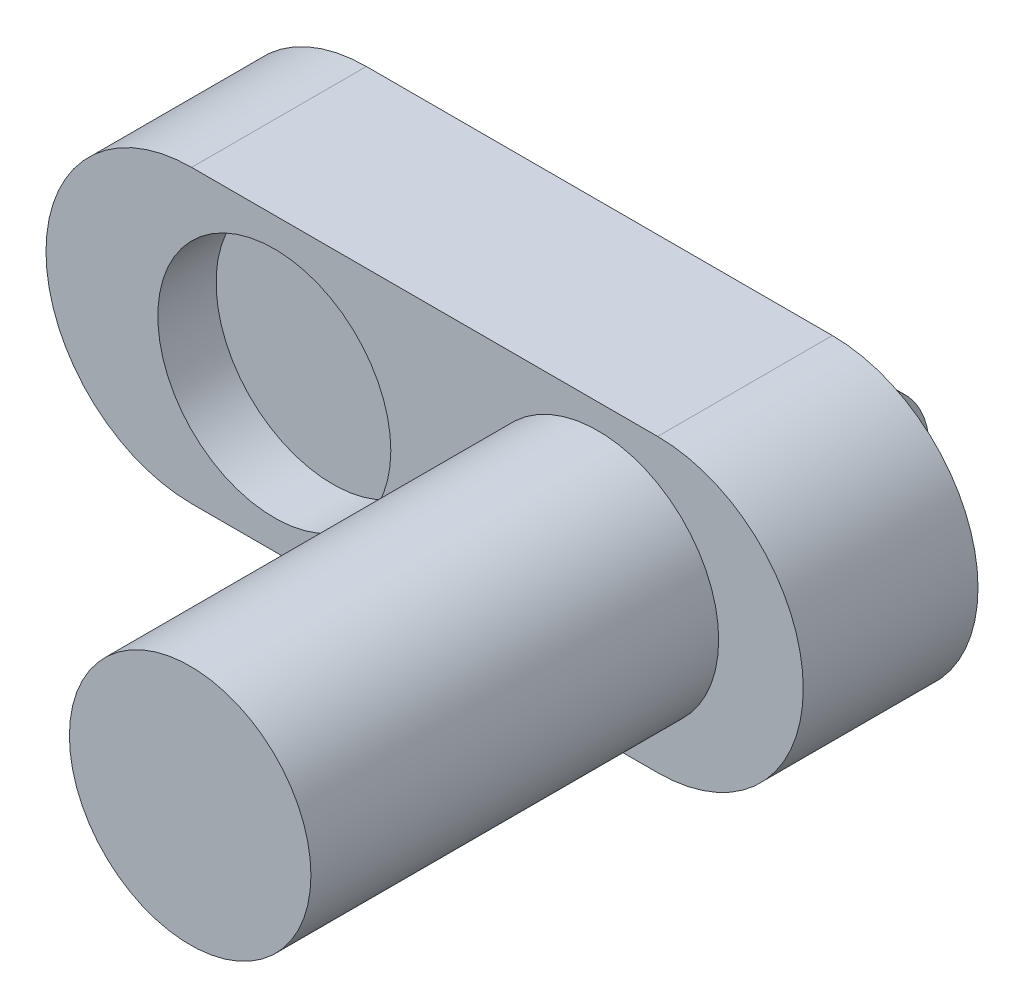
ISO-10303-21;
HEADER;
FILE_DESCRIPTION(('STEP AP214'),'2;1');
FILE_NAME('part.step','',(''),(''),'','','');
FILE_SCHEMA(('AUTOMOTIVE_DESIGN { 1 0 10303 214 1 1 1 1 }'));
ENDSEC;
DATA;
#1=APPLICATION_CONTEXT('core data for automotive mechanical design processes');
#2=APPLICATION_PROTOCOL_DEFINITION('international standard','automotive_design',2000,#1);
#3=PRODUCT_CONTEXT('',#1,'mechanical');
#4=PRODUCT('Part','Part','',(#3));
#5=PRODUCT_RELATED_PRODUCT_CATEGORY('part','',(#4));
#6=PRODUCT_DEFINITION_FORMATION('','',#4);
#7=PRODUCT_DEFINITION_CONTEXT('part definition',#1,'design');
#8=PRODUCT_DEFINITION('design','',#6,#7);
#9=PRODUCT_DEFINITION_SHAPE('','',#8);
#10=(LENGTH_UNIT() NAMED_UNIT(*) SI_UNIT(.MILLI.,.METRE.));
#11=(NAMED_UNIT(*) PLANE_ANGLE_UNIT() SI_UNIT($,.RADIAN.));
#12=(NAMED_UNIT(*) SI_UNIT($,.STERADIAN.) SOLID_ANGLE_UNIT());
#13=UNCERTAINTY_MEASURE_WITH_UNIT(LENGTH_MEASURE(1.E-05),#10,'distance_accuracy_value','');
#14=(GEOMETRIC_REPRESENTATION_CONTEXT(3) GLOBAL_UNCERTAINTY_ASSIGNED_CONTEXT((#13)) GLOBAL_UNIT_ASSIGNED_CONTEXT((#10,
#11,#12)) REPRESENTATION_CONTEXT('',''));
#15=CARTESIAN_POINT('',(0.,0.,0.));
#16=DIRECTION('',(0.,0.,1.));
#17=DIRECTION('',(1.,0.,0.));
#18=AXIS2_PLACEMENT_3D('',#15,#16,#17);
#19=CARTESIAN_POINT('',(-20.,0.,0.));
#20=DIRECTION('',(0.,0.,1.));
#21=DIRECTION('',(1.,0.,0.));
#22=AXIS2_PLACEMENT_3D('',#19,#20,#21);
#23=PLANE('',#22);
#24=CARTESIAN_POINT('',(-20.,0.,0.));
#25=DIRECTION('',(0.,0.,1.));
#26=DIRECTION('',(1.,0.,0.));
#27=AXIS2_PLACEMENT_3D('',#24,#25,#26);
#28=CIRCLE('',#27,12.5);
#29=CARTESIAN_POINT('',(-20.,12.5,0.));
#30=VERTEX_POINT('',#29);
#31=CARTESIAN_POINT('',(-20.,-12.5,0.));
#32=VERTEX_POINT('',#31);
#33=EDGE_CURVE('E180',#30,#32,#28,.T.);
#34=ORIENTED_EDGE('',*,*,#33,.F.);
#35=DIRECTION('',(-1.,0.,0.));
#36=VECTOR('',#35,1.);
#37=CARTESIAN_POINT('',(-20.,12.5,0.));
#38=LINE('',#37,#36);
#39=CARTESIAN_POINT('',(20.,12.5,0.));
#40=VERTEX_POINT('',#39);
#41=EDGE_CURVE('E72',#40,#30,#38,.T.);
#42=ORIENTED_EDGE('',*,*,#41,.F.);
#43=CARTESIAN_POINT('',(20.,0.,0.));
#44=DIRECTION('',(0.,0.,1.));
#45=DIRECTION('',(1.,0.,0.));
#46=AXIS2_PLACEMENT_3D('',#43,#44,#45);
#47=CIRCLE('',#46,12.5);
#48=CARTESIAN_POINT('',(20.,-12.5,0.));
#49=VERTEX_POINT('',#48);
#50=EDGE_CURVE('E185',#49,#40,#47,.T.);
#51=ORIENTED_EDGE('',*,*,#50,.F.);
#52=DIRECTION('',(1.,0.,0.));
#53=VECTOR('',#52,1.);
#54=CARTESIAN_POINT('',(-20.,-12.5,0.));
#55=LINE('',#54,#53);
#56=EDGE_CURVE('E183',#32,#49,#55,.T.);
#57=ORIENTED_EDGE('',*,*,#56,.F.);
#58=EDGE_LOOP('',(#34,#42,#51,#57));
#59=FACE_BOUND('',#58,.T.);
#60=DIRECTION('',(0.,-1.,0.));
#61=VECTOR('',#60,1.);
#62=CARTESIAN_POINT('',(20.,6.25,0.));
#63=LINE('',#62,#61);
#64=CARTESIAN_POINT('',(20.,6.25,0.));
#65=VERTEX_POINT('',#64);
#66=CARTESIAN_POINT('',(20.,-6.25,0.));
#67=VERTEX_POINT('',#66);
#68=EDGE_CURVE('E135',#65,#67,#63,.T.);
#69=ORIENTED_EDGE('',*,*,#68,.F.);
#70=DIRECTION('',(1.,0.,0.));
#71=VECTOR('',#70,1.);
#72=CARTESIAN_POINT('',(-20.,6.25,0.));
#73=LINE('',#72,#71);
#74=CARTESIAN_POINT('',(-20.,6.25,0.));
#75=VERTEX_POINT('',#74);
#76=EDGE_CURVE('E134',#75,#65,#73,.T.);
#77=ORIENTED_EDGE('',*,*,#76,.F.);
#78=DIRECTION('',(0.,-1.,0.));
#79=VECTOR('',#78,1.);
#80=CARTESIAN_POINT('',(-20.,0.,0.));
#81=LINE('',#80,#79);
#82=CARTESIAN_POINT('',(-20.,-6.25,0.));
#83=VERTEX_POINT('',#82);
#84=EDGE_CURVE('E128',#75,#83,#81,.T.);
#85=ORIENTED_EDGE('',*,*,#84,.T.);
#86=DIRECTION('',(1.,0.,0.));
#87=VECTOR('',#86,1.);
#88=CARTESIAN_POINT('',(-20.,-6.25,0.));
#89=LINE('',#88,#87);
#90=EDGE_CURVE('E114',#83,#67,#89,.T.);
#91=ORIENTED_EDGE('',*,*,#90,.T.);
#92=EDGE_LOOP('',(#69,#77,#85,#91));
#93=FACE_BOUND('',#92,.T.);
#94=ADVANCED_FACE('F49',(#59,#93),#23,.F.);
#95=CARTESIAN_POINT('',(-20.,0.,5.));
#96=DIRECTION('',(0.,0.,-1.));
#97=DIRECTION('',(-1.,0.,0.));
#98=AXIS2_PLACEMENT_3D('',#95,#96,#97);
#99=CYLINDRICAL_SURFACE('',#98,12.5);
#100=ORIENTED_EDGE('',*,*,#33,.T.);
#101=DIRECTION('',(0.,0.,-1.));
#102=VECTOR('',#101,1.);
#103=CARTESIAN_POINT('',(-20.,-12.5,5.));
#104=LINE('',#103,#102);
#105=CARTESIAN_POINT('',(-20.,-12.5,15.));
#106=VERTEX_POINT('',#105);
#107=EDGE_CURVE('E13',#106,#32,#104,.T.);
#108=ORIENTED_EDGE('',*,*,#107,.F.);
#109=CARTESIAN_POINT('',(-20.,0.,15.));
#110=DIRECTION('',(0.,0.,1.));
#111=DIRECTION('',(1.,0.,0.));
#112=AXIS2_PLACEMENT_3D('',#109,#110,#111);
#113=CIRCLE('',#112,12.5);
#114=CARTESIAN_POINT('',(-20.,12.5,15.));
#115=VERTEX_POINT('',#114);
#116=EDGE_CURVE('E166',#115,#106,#113,.T.);
#117=ORIENTED_EDGE('',*,*,#116,.F.);
#118=DIRECTION('',(0.,0.,-1.));
#119=VECTOR('',#118,1.);
#120=CARTESIAN_POINT('',(-20.,12.5,5.));
#121=LINE('',#120,#119);
#122=EDGE_CURVE('E188',#115,#30,#121,.T.);
#123=ORIENTED_EDGE('',*,*,#122,.T.);
#124=EDGE_LOOP('',(#100,#108,#117,#123));
#125=FACE_BOUND('',#124,.T.);
#126=ADVANCED_FACE('F51',(#125),#99,.T.);
#127=CARTESIAN_POINT('',(-20.,-12.5,5.));
#128=DIRECTION('',(0.,1.,0.));
#129=DIRECTION('',(0.,0.,1.));
#130=AXIS2_PLACEMENT_3D('',#127,#128,#129);
#131=PLANE('',#130);
#132=ORIENTED_EDGE('',*,*,#56,.T.);
#133=DIRECTION('',(0.,0.,-1.));
#134=VECTOR('',#133,1.);
#135=CARTESIAN_POINT('',(20.,-12.5,5.));
#136=LINE('',#135,#134);
#137=CARTESIAN_POINT('',(20.,-12.5,15.));
#138=VERTEX_POINT('',#137);
#139=EDGE_CURVE('E57',#138,#49,#136,.T.);
#140=ORIENTED_EDGE('',*,*,#139,.F.);
#141=DIRECTION('',(1.,0.,0.));
#142=VECTOR('',#141,1.);
#143=CARTESIAN_POINT('',(-20.,-12.5,15.));
#144=LINE('',#143,#142);
#145=EDGE_CURVE('E171',#106,#138,#144,.T.);
#146=ORIENTED_EDGE('',*,*,#145,.F.);
#147=ORIENTED_EDGE('',*,*,#107,.T.);
#148=EDGE_LOOP('',(#132,#140,#146,#147));
#149=FACE_BOUND('',#148,.T.);
#150=ADVANCED_FACE('F206',(#149),#131,.F.);
#151=CARTESIAN_POINT('',(20.,0.,5.));
#152=DIRECTION('',(0.,0.,-1.));
#153=DIRECTION('',(-1.,0.,0.));
#154=AXIS2_PLACEMENT_3D('',#151,#152,#153);
#155=CYLINDRICAL_SURFACE('',#154,12.5);
#156=ORIENTED_EDGE('',*,*,#50,.T.);
#157=DIRECTION('',(0.,0.,-1.));
#158=VECTOR('',#157,1.);
#159=CARTESIAN_POINT('',(20.,12.5,5.));
#160=LINE('',#159,#158);
#161=CARTESIAN_POINT('',(20.,12.5,15.));
#162=VERTEX_POINT('',#161);
#163=EDGE_CURVE('E190',#162,#40,#160,.T.);
#164=ORIENTED_EDGE('',*,*,#163,.F.);
#165=CARTESIAN_POINT('',(20.,0.,15.));
#166=DIRECTION('',(0.,0.,1.));
#167=DIRECTION('',(1.,0.,0.));
#168=AXIS2_PLACEMENT_3D('',#165,#166,#167);
#169=CIRCLE('',#168,12.5);
#170=EDGE_CURVE('E174',#138,#162,#169,.T.);
#171=ORIENTED_EDGE('',*,*,#170,.F.);
#172=ORIENTED_EDGE('',*,*,#139,.T.);
#173=EDGE_LOOP('',(#156,#164,#171,#172));
#174=FACE_BOUND('',#173,.T.);
#175=ADVANCED_FACE('F195',(#174),#155,.T.);
#176=CARTESIAN_POINT('',(-20.,12.5,5.));
#177=DIRECTION('',(0.,-1.,0.));
#178=DIRECTION('',(0.,0.,-1.));
#179=AXIS2_PLACEMENT_3D('',#176,#177,#178);
#180=PLANE('',#179);
#181=ORIENTED_EDGE('',*,*,#41,.T.);
#182=ORIENTED_EDGE('',*,*,#122,.F.);
#183=DIRECTION('',(-1.,0.,0.));
#184=VECTOR('',#183,1.);
#185=CARTESIAN_POINT('',(-20.,12.5,15.));
#186=LINE('',#185,#184);
#187=EDGE_CURVE('E177',#162,#115,#186,.T.);
#188=ORIENTED_EDGE('',*,*,#187,.F.);
#189=ORIENTED_EDGE('',*,*,#163,.T.);
#190=EDGE_LOOP('',(#181,#182,#188,#189));
#191=FACE_BOUND('',#190,.T.);
#192=ADVANCED_FACE('F203',(#191),#180,.F.);
#193=CARTESIAN_POINT('',(-20.,0.,15.));
#194=DIRECTION('',(0.,0.,1.));
#195=DIRECTION('',(1.,0.,0.));
#196=AXIS2_PLACEMENT_3D('',#193,#194,#195);
#197=PLANE('',#196);
#198=CARTESIAN_POINT('',(14.8749865916251,0.,15.));
#199=DIRECTION('',(0.,0.,1.));
#200=DIRECTION('',(1.,0.,0.));
#201=AXIS2_PLACEMENT_3D('',#198,#199,#200);
#202=CIRCLE('',#201,10.3660719973332);
#203=CARTESIAN_POINT('',(25.2410585889583,0.,15.));
#204=VERTEX_POINT('',#203);
#205=EDGE_CURVE('E153',#204,#204,#202,.T.);
#206=ORIENTED_EDGE('',*,*,#205,.F.);
#207=EDGE_LOOP('',(#206));
#208=FACE_BOUND('',#207,.T.);
#209=CARTESIAN_POINT('',(-12.9020326853335,0.,15.));
#210=DIRECTION('',(0.,0.,1.));
#211=DIRECTION('',(1.,0.,0.));
#212=AXIS2_PLACEMENT_3D('',#209,#210,#211);
#213=CIRCLE('',#212,10.);
#214=CARTESIAN_POINT('',(-2.90203268533348,0.,15.));
#215=VERTEX_POINT('',#214);
#216=EDGE_CURVE('E160',#215,#215,#213,.T.);
#217=ORIENTED_EDGE('',*,*,#216,.F.);
#218=EDGE_LOOP('',(#217));
#219=FACE_BOUND('',#218,.T.);
#220=ORIENTED_EDGE('',*,*,#116,.T.);
#221=ORIENTED_EDGE('',*,*,#145,.T.);
#222=ORIENTED_EDGE('',*,*,#170,.T.);
#223=ORIENTED_EDGE('',*,*,#187,.T.);
#224=EDGE_LOOP('',(#220,#221,#222,#223));
#225=FACE_BOUND('',#224,.T.);
#226=ADVANCED_FACE('F205',(#208,#219,#225),#197,.T.);
#227=CARTESIAN_POINT('',(-12.9020326853335,0.,10.));
#228=DIRECTION('',(0.,0.,1.));
#229=DIRECTION('',(1.,0.,0.));
#230=AXIS2_PLACEMENT_3D('',#227,#228,#229);
#231=CYLINDRICAL_SURFACE('',#230,10.);
#232=CARTESIAN_POINT('',(-12.9020326853335,0.,10.));
#233=DIRECTION('',(0.,0.,1.));
#234=DIRECTION('',(1.,0.,0.));
#235=AXIS2_PLACEMENT_3D('',#232,#233,#234);
#236=CIRCLE('',#235,10.);
#237=CARTESIAN_POINT('',(-2.90203268533348,0.,10.));
#238=VERTEX_POINT('',#237);
#239=EDGE_CURVE('E163',#238,#238,#236,.T.);
#240=ORIENTED_EDGE('',*,*,#239,.F.);
#241=EDGE_LOOP('',(#240));
#242=FACE_BOUND('',#241,.T.);
#243=ORIENTED_EDGE('',*,*,#216,.T.);
#244=EDGE_LOOP('',(#243));
#245=FACE_BOUND('',#244,.T.);
#246=ADVANCED_FACE('F226',(#242,#245),#231,.F.);
#247=CARTESIAN_POINT('',(-12.9020326853335,0.,10.));
#248=DIRECTION('',(0.,0.,1.));
#249=DIRECTION('',(1.,0.,0.));
#250=AXIS2_PLACEMENT_3D('',#247,#248,#249);
#251=PLANE('',#250);
#252=ORIENTED_EDGE('',*,*,#239,.T.);
#253=EDGE_LOOP('',(#252));
#254=FACE_BOUND('',#253,.T.);
#255=ADVANCED_FACE('F231',(#254),#251,.T.);
#256=CARTESIAN_POINT('',(14.8749865916251,0.,50.));
#257=DIRECTION('',(0.,0.,-1.));
#258=DIRECTION('',(-1.,0.,0.));
#259=AXIS2_PLACEMENT_3D('',#256,#257,#258);
#260=CYLINDRICAL_SURFACE('',#259,10.3660719973332);
#261=CARTESIAN_POINT('',(14.8749865916251,0.,50.));
#262=DIRECTION('',(0.,0.,1.));
#263=DIRECTION('',(1.,0.,0.));
#264=AXIS2_PLACEMENT_3D('',#261,#262,#263);
#265=CIRCLE('',#264,10.3660719973332);
#266=CARTESIAN_POINT('',(25.2410585889583,0.,50.));
#267=VERTEX_POINT('',#266);
#268=EDGE_CURVE('E157',#267,#267,#265,.T.);
#269=ORIENTED_EDGE('',*,*,#268,.F.);
#270=EDGE_LOOP('',(#269));
#271=FACE_BOUND('',#270,.T.);
#272=ORIENTED_EDGE('',*,*,#205,.T.);
#273=EDGE_LOOP('',(#272));
#274=FACE_BOUND('',#273,.T.);
#275=ADVANCED_FACE('F238',(#271,#274),#260,.T.);
#276=CARTESIAN_POINT('',(14.8749865916251,0.,50.));
#277=DIRECTION('',(0.,0.,1.));
#278=DIRECTION('',(1.,0.,0.));
#279=AXIS2_PLACEMENT_3D('',#276,#277,#278);
#280=PLANE('',#279);
#281=ORIENTED_EDGE('',*,*,#268,.T.);
#282=EDGE_LOOP('',(#281));
#283=FACE_BOUND('',#282,.T.);
#284=ADVANCED_FACE('F240',(#283),#280,.T.);
#285=CARTESIAN_POINT('',(-20.,6.25,0.));
#286=DIRECTION('',(0.,1.,0.));
#287=DIRECTION('',(0.,0.,1.));
#288=AXIS2_PLACEMENT_3D('',#285,#286,#287);
#289=PLANE('',#288);
#290=DIRECTION('',(0.,0.,1.));
#291=VECTOR('',#290,1.);
#292=CARTESIAN_POINT('',(20.,6.25,0.));
#293=LINE('',#292,#291);
#294=CARTESIAN_POINT('',(20.,6.25,-4.5));
#295=VERTEX_POINT('',#294);
#296=EDGE_CURVE('E137',#295,#65,#293,.T.);
#297=ORIENTED_EDGE('',*,*,#296,.F.);
#298=DIRECTION('',(1.,0.,0.));
#299=VECTOR('',#298,1.);
#300=CARTESIAN_POINT('',(-20.,6.25,-4.5));
#301=LINE('',#300,#299);
#302=CARTESIAN_POINT('',(-20.,6.25,-4.5));
#303=VERTEX_POINT('',#302);
#304=EDGE_CURVE('E154',#303,#295,#301,.T.);
#305=ORIENTED_EDGE('',*,*,#304,.F.);
#306=DIRECTION('',(0.,0.,1.));
#307=VECTOR('',#306,1.);
#308=CARTESIAN_POINT('',(-20.,6.25,0.));
#309=LINE('',#308,#307);
#310=EDGE_CURVE('E122',#303,#75,#309,.T.);
#311=ORIENTED_EDGE('',*,*,#310,.T.);
#312=ORIENTED_EDGE('',*,*,#76,.T.);
#313=EDGE_LOOP('',(#297,#305,#311,#312));
#314=FACE_BOUND('',#313,.T.);
#315=ADVANCED_FACE('F246',(#314),#289,.T.);
#316=CARTESIAN_POINT('',(-20.,0.,-1.29581704376749));
#317=DIRECTION('',(1.,0.,0.));
#318=DIRECTION('',(0.,0.,-1.));
#319=AXIS2_PLACEMENT_3D('',#316,#317,#318);
#320=CYLINDRICAL_SURFACE('',#319,7.02348121781577);
#321=CARTESIAN_POINT('',(20.,0.,-1.29581704376749));
#322=DIRECTION('',(1.,0.,0.));
#323=DIRECTION('',(0.,0.,1.));
#324=AXIS2_PLACEMENT_3D('',#321,#322,#323);
#325=CIRCLE('',#324,7.02348121781577);
#326=CARTESIAN_POINT('',(20.,-6.25,-4.5));
#327=VERTEX_POINT('',#326);
#328=EDGE_CURVE('E146',#327,#295,#325,.T.);
#329=ORIENTED_EDGE('',*,*,#328,.F.);
#330=DIRECTION('',(1.,0.,0.));
#331=VECTOR('',#330,1.);
#332=CARTESIAN_POINT('',(-20.,-6.25,-4.5));
#333=LINE('',#332,#331);
#334=CARTESIAN_POINT('',(-20.,-6.25,-4.5));
#335=VERTEX_POINT('',#334);
#336=EDGE_CURVE('E121',#335,#327,#333,.T.);
#337=ORIENTED_EDGE('',*,*,#336,.F.);
#338=CARTESIAN_POINT('',(-20.,0.,-1.29581704376749));
#339=DIRECTION('',(1.,0.,0.));
#340=DIRECTION('',(0.,0.,1.));
#341=AXIS2_PLACEMENT_3D('',#338,#339,#340);
#342=CIRCLE('',#341,7.02348121781577);
#343=EDGE_CURVE('E131',#335,#303,#342,.T.);
#344=ORIENTED_EDGE('',*,*,#343,.T.);
#345=ORIENTED_EDGE('',*,*,#304,.T.);
#346=EDGE_LOOP('',(#329,#337,#344,#345));
#347=FACE_BOUND('',#346,.T.);
#348=ADVANCED_FACE('F256',(#347),#320,.T.);
#349=CARTESIAN_POINT('',(-20.,-6.25,-4.5));
#350=DIRECTION('',(0.,-1.,0.));
#351=DIRECTION('',(0.,0.,-1.));
#352=AXIS2_PLACEMENT_3D('',#349,#350,#351);
#353=PLANE('',#352);
#354=DIRECTION('',(0.,0.,-1.));
#355=VECTOR('',#354,1.);
#356=CARTESIAN_POINT('',(20.,-6.25,-4.5));
#357=LINE('',#356,#355);
#358=EDGE_CURVE('E64',#67,#327,#357,.T.);
#359=ORIENTED_EDGE('',*,*,#358,.F.);
#360=ORIENTED_EDGE('',*,*,#90,.F.);
#361=DIRECTION('',(0.,0.,-1.));
#362=VECTOR('',#361,1.);
#363=CARTESIAN_POINT('',(-20.,-6.25,-4.5));
#364=LINE('',#363,#362);
#365=EDGE_CURVE('E117',#83,#335,#364,.T.);
#366=ORIENTED_EDGE('',*,*,#365,.T.);
#367=ORIENTED_EDGE('',*,*,#336,.T.);
#368=EDGE_LOOP('',(#359,#360,#366,#367));
#369=FACE_BOUND('',#368,.T.);
#370=ADVANCED_FACE('F116',(#369),#353,.T.);
#371=CARTESIAN_POINT('',(-20.,0.,-1.29581704376749));
#372=DIRECTION('',(-1.,0.,0.));
#373=DIRECTION('',(0.,0.,1.));
#374=AXIS2_PLACEMENT_3D('',#371,#372,#373);
#375=PLANE('',#374);
#376=CARTESIAN_POINT('',(-20.,0.,-4.15964913079163));
#377=DIRECTION('',(1.,0.,0.));
#378=DIRECTION('',(0.,0.,-1.));
#379=AXIS2_PLACEMENT_3D('',#376,#377,#378);
#380=CIRCLE('',#379,2.25);
#381=CARTESIAN_POINT('',(-20.,0.,-6.40964913079163));
#382=VERTEX_POINT('',#381);
#383=EDGE_CURVE('E147',#382,#382,#380,.T.);
#384=ORIENTED_EDGE('',*,*,#383,.T.);
#385=EDGE_LOOP('',(#384));
#386=FACE_BOUND('',#385,.T.);
#387=ORIENTED_EDGE('',*,*,#84,.F.);
#388=ORIENTED_EDGE('',*,*,#310,.F.);
#389=ORIENTED_EDGE('',*,*,#343,.F.);
#390=ORIENTED_EDGE('',*,*,#365,.F.);
#391=EDGE_LOOP('',(#387,#388,#389,#390));
#392=FACE_BOUND('',#391,.T.);
#393=ADVANCED_FACE('F126',(#386,#392),#375,.T.);
#394=CARTESIAN_POINT('',(20.,0.,-1.29581704376749));
#395=DIRECTION('',(-1.,0.,0.));
#396=DIRECTION('',(0.,0.,1.));
#397=AXIS2_PLACEMENT_3D('',#394,#395,#396);
#398=PLANE('',#397);
#399=CARTESIAN_POINT('',(20.,0.,-4.15964913079163));
#400=DIRECTION('',(1.,0.,0.));
#401=DIRECTION('',(0.,0.,-1.));
#402=AXIS2_PLACEMENT_3D('',#399,#400,#401);
#403=CIRCLE('',#402,2.25);
#404=CARTESIAN_POINT('',(20.,0.,-6.40964913079163));
#405=VERTEX_POINT('',#404);
#406=EDGE_CURVE('E140',#405,#405,#403,.T.);
#407=ORIENTED_EDGE('',*,*,#406,.F.);
#408=EDGE_LOOP('',(#407));
#409=FACE_BOUND('',#408,.T.);
#410=ORIENTED_EDGE('',*,*,#68,.T.);
#411=ORIENTED_EDGE('',*,*,#358,.T.);
#412=ORIENTED_EDGE('',*,*,#328,.T.);
#413=ORIENTED_EDGE('',*,*,#296,.T.);
#414=EDGE_LOOP('',(#410,#411,#412,#413));
#415=FACE_BOUND('',#414,.T.);
#416=ADVANCED_FACE('F263',(#409,#415),#398,.F.);
#417=CARTESIAN_POINT('',(-20.,0.,-4.15964913079163));
#418=DIRECTION('',(1.,0.,0.));
#419=DIRECTION('',(0.,0.,-1.));
#420=AXIS2_PLACEMENT_3D('',#417,#418,#419);
#421=CYLINDRICAL_SURFACE('',#420,2.25);
#422=ORIENTED_EDGE('',*,*,#383,.F.);
#423=EDGE_LOOP('',(#422));
#424=FACE_BOUND('',#423,.T.);
#425=ORIENTED_EDGE('',*,*,#406,.T.);
#426=EDGE_LOOP('',(#425));
#427=FACE_BOUND('',#426,.T.);
#428=ADVANCED_FACE('F266',(#424,#427),#421,.F.);
#429=CLOSED_SHELL('',(#94,#126,#150,#175,#192,#226,#246,#255,#275,#284,#315,#348,#370,#393,#416,#428));
#430=MANIFOLD_SOLID_BREP('B2',#429);
#431=ADVANCED_BREP_SHAPE_REPRESENTATION('',(#18,#430),#14);
#432=SHAPE_DEFINITION_REPRESENTATION(#9,#431);
ENDSEC;
END-ISO-10303-21;
